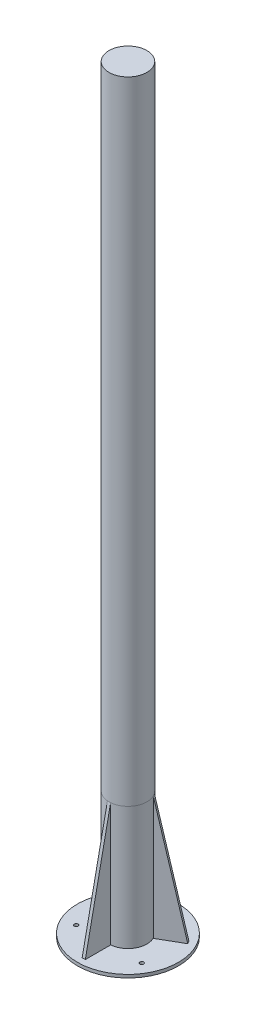
ISO-10303-21;
HEADER;
FILE_DESCRIPTION(('STEP AP214'),'2;1');
FILE_NAME('part.step','',(''),(''),'','','');
FILE_SCHEMA(('AUTOMOTIVE_DESIGN { 1 0 10303 214 1 1 1 1 }'));
ENDSEC;
DATA;
#1=APPLICATION_CONTEXT('core data for automotive mechanical design processes');
#2=APPLICATION_PROTOCOL_DEFINITION('international standard','automotive_design',2000,#1);
#3=PRODUCT_CONTEXT('',#1,'mechanical');
#4=PRODUCT('Part','Part','',(#3));
#5=PRODUCT_RELATED_PRODUCT_CATEGORY('part','',(#4));
#6=PRODUCT_DEFINITION_FORMATION('','',#4);
#7=PRODUCT_DEFINITION_CONTEXT('part definition',#1,'design');
#8=PRODUCT_DEFINITION('design','',#6,#7);
#9=PRODUCT_DEFINITION_SHAPE('','',#8);
#10=(LENGTH_UNIT() NAMED_UNIT(*) SI_UNIT(.MILLI.,.METRE.));
#11=(NAMED_UNIT(*) PLANE_ANGLE_UNIT() SI_UNIT($,.RADIAN.));
#12=(NAMED_UNIT(*) SI_UNIT($,.STERADIAN.) SOLID_ANGLE_UNIT());
#13=UNCERTAINTY_MEASURE_WITH_UNIT(LENGTH_MEASURE(1.E-05),#10,'distance_accuracy_value','');
#14=(GEOMETRIC_REPRESENTATION_CONTEXT(3) GLOBAL_UNCERTAINTY_ASSIGNED_CONTEXT((#13)) GLOBAL_UNIT_ASSIGNED_CONTEXT((#10,
#11,#12)) REPRESENTATION_CONTEXT('',''));
#15=CARTESIAN_POINT('',(0.,0.,0.));
#16=DIRECTION('',(0.,0.,1.));
#17=DIRECTION('',(1.,0.,0.));
#18=AXIS2_PLACEMENT_3D('',#15,#16,#17);
#19=CARTESIAN_POINT('',(0.,1195.,0.));
#20=DIRECTION('',(0.,-1.,0.));
#21=DIRECTION('',(0.,0.,-1.));
#22=AXIS2_PLACEMENT_3D('',#19,#20,#21);
#23=CYLINDRICAL_SURFACE('',#22,30.);
#24=CARTESIAN_POINT('',(0.,1195.,0.));
#25=DIRECTION('',(0.,1.,0.));
#26=DIRECTION('',(0.,0.,1.));
#27=AXIS2_PLACEMENT_3D('',#24,#25,#26);
#28=CIRCLE('',#27,30.);
#29=CARTESIAN_POINT('',(0.,1195.,30.));
#30=VERTEX_POINT('',#29);
#31=EDGE_CURVE('E11',#30,#30,#28,.T.);
#32=ORIENTED_EDGE('',*,*,#31,.F.);
#33=EDGE_LOOP('',(#32));
#34=FACE_BOUND('',#33,.T.);
#35=CARTESIAN_POINT('',(0.,195.,0.));
#36=DIRECTION('',(0.,1.,0.));
#37=DIRECTION('',(0.,0.,1.));
#38=AXIS2_PLACEMENT_3D('',#35,#36,#37);
#39=CIRCLE('',#38,30.);
#40=CARTESIAN_POINT('',(0.,195.,30.));
#41=VERTEX_POINT('',#40);
#42=EDGE_CURVE('E48',#41,#41,#39,.T.);
#43=ORIENTED_EDGE('',*,*,#42,.T.);
#44=EDGE_LOOP('',(#43));
#45=FACE_BOUND('',#44,.T.);
#46=ADVANCED_FACE('F45',(#34,#45),#23,.T.);
#47=CARTESIAN_POINT('',(0.,1195.,0.));
#48=DIRECTION('',(0.,1.,0.));
#49=DIRECTION('',(0.,0.,1.));
#50=AXIS2_PLACEMENT_3D('',#47,#48,#49);
#51=PLANE('',#50);
#52=ORIENTED_EDGE('',*,*,#31,.T.);
#53=EDGE_LOOP('',(#52));
#54=FACE_BOUND('',#53,.T.);
#55=ADVANCED_FACE('F60',(#54),#51,.T.);
#56=CARTESIAN_POINT('',(0.,195.,0.));
#57=DIRECTION('',(0.,1.,0.));
#58=DIRECTION('',(0.,0.,1.));
#59=AXIS2_PLACEMENT_3D('',#56,#57,#58);
#60=PLANE('',#59);
#61=ORIENTED_EDGE('',*,*,#42,.F.);
#62=EDGE_LOOP('',(#61));
#63=FACE_BOUND('',#62,.T.);
#64=ADVANCED_FACE('F58',(#63),#60,.F.);
#65=CLOSED_SHELL('',(#46,#55,#64));
#66=MANIFOLD_SOLID_BREP('B2',#65);
#67=CARTESIAN_POINT('',(-24.7307621135333,195.,-17.1650635094609));
#68=DIRECTION('',(-0.848360824371378,0.200944143721331,-0.489801350320737));
#69=DIRECTION('',(-0.174022733204385,-0.97960270064149,-0.100472071860664));
#70=AXIS2_PLACEMENT_3D('',#67,#68,#69);
#71=PLANE('',#70);
#72=DIRECTION('',(-0.499999999999992,0.,0.866025403784443));
#73=VECTOR('',#72,1.);
#74=CARTESIAN_POINT('',(-59.3717782649111,0.,-37.1650635094605));
#75=LINE('',#74,#73);
#76=CARTESIAN_POINT('',(-59.3717782649111,0.,-37.1650635094605));
#77=VERTEX_POINT('',#76);
#78=CARTESIAN_POINT('',(-61.871778264911,0.,-32.8349364905383));
#79=VERTEX_POINT('',#78);
#80=EDGE_CURVE('E100',#77,#79,#75,.T.);
#81=ORIENTED_EDGE('',*,*,#80,.T.);
#82=DIRECTION('',(-0.174022733204385,-0.97960270064149,-0.100472071860664));
#83=VECTOR('',#82,1.);
#84=CARTESIAN_POINT('',(-27.2307621135333,195.,-12.8349364905386));
#85=LINE('',#84,#83);
#86=CARTESIAN_POINT('',(-27.2307621135333,195.,-12.8349364905386));
#87=VERTEX_POINT('',#86);
#88=EDGE_CURVE('E131',#87,#79,#85,.T.);
#89=ORIENTED_EDGE('',*,*,#88,.F.);
#90=DIRECTION('',(-0.499999999999992,0.,0.866025403784443));
#91=VECTOR('',#90,1.);
#92=CARTESIAN_POINT('',(-24.7307621135333,195.,-17.1650635094609));
#93=LINE('',#92,#91);
#94=CARTESIAN_POINT('',(-24.7307621135333,195.,-17.1650635094609));
#95=VERTEX_POINT('',#94);
#96=EDGE_CURVE('E43',#95,#87,#93,.T.);
#97=ORIENTED_EDGE('',*,*,#96,.F.);
#98=DIRECTION('',(-0.174022733204385,-0.97960270064149,-0.100472071860664));
#99=VECTOR('',#98,1.);
#100=CARTESIAN_POINT('',(-24.7307621135333,195.,-17.1650635094609));
#101=LINE('',#100,#99);
#102=EDGE_CURVE('E132',#95,#77,#101,.T.);
#103=ORIENTED_EDGE('',*,*,#102,.T.);
#104=EDGE_LOOP('',(#81,#89,#97,#103));
#105=FACE_BOUND('',#104,.T.);
#106=ADVANCED_FACE('F97',(#105),#71,.T.);
#107=CARTESIAN_POINT('',(-24.7307621135333,0.,-17.1650635094609));
#108=DIRECTION('',(0.866025403784443,0.,0.499999999999992));
#109=DIRECTION('',(0.499999999999992,0.,-0.866025403784443));
#110=AXIS2_PLACEMENT_3D('',#107,#108,#109);
#111=PLANE('',#110);
#112=ORIENTED_EDGE('',*,*,#96,.T.);
#113=DIRECTION('',(0.,1.,0.));
#114=VECTOR('',#113,1.);
#115=CARTESIAN_POINT('',(-27.2307621135333,0.,-12.8349364905386));
#116=LINE('',#115,#114);
#117=CARTESIAN_POINT('',(-27.2307621135333,0.,-12.8349364905386));
#118=VERTEX_POINT('',#117);
#119=EDGE_CURVE('E141',#118,#87,#116,.T.);
#120=ORIENTED_EDGE('',*,*,#119,.F.);
#121=DIRECTION('',(-0.499999999999992,0.,0.866025403784443));
#122=VECTOR('',#121,1.);
#123=CARTESIAN_POINT('',(-24.7307621135333,0.,-17.1650635094609));
#124=LINE('',#123,#122);
#125=CARTESIAN_POINT('',(-24.7307621135333,0.,-17.1650635094609));
#126=VERTEX_POINT('',#125);
#127=EDGE_CURVE('E105',#126,#118,#124,.T.);
#128=ORIENTED_EDGE('',*,*,#127,.F.);
#129=DIRECTION('',(0.,1.,0.));
#130=VECTOR('',#129,1.);
#131=CARTESIAN_POINT('',(-24.7307621135333,0.,-17.1650635094609));
#132=LINE('',#131,#130);
#133=EDGE_CURVE('E135',#126,#95,#132,.T.);
#134=ORIENTED_EDGE('',*,*,#133,.T.);
#135=EDGE_LOOP('',(#112,#120,#128,#134));
#136=FACE_BOUND('',#135,.T.);
#137=ADVANCED_FACE('F151',(#136),#111,.T.);
#138=CARTESIAN_POINT('',(-59.3717782649111,0.,-37.1650635094605));
#139=DIRECTION('',(0.,-1.,0.));
#140=DIRECTION('',(0.866025403784443,0.,0.499999999999992));
#141=AXIS2_PLACEMENT_3D('',#138,#139,#140);
#142=PLANE('',#141);
#143=ORIENTED_EDGE('',*,*,#127,.T.);
#144=DIRECTION('',(0.866025403784443,0.,0.499999999999992));
#145=VECTOR('',#144,1.);
#146=CARTESIAN_POINT('',(-61.871778264911,0.,-32.8349364905383));
#147=LINE('',#146,#145);
#148=EDGE_CURVE('E137',#79,#118,#147,.T.);
#149=ORIENTED_EDGE('',*,*,#148,.F.);
#150=ORIENTED_EDGE('',*,*,#80,.F.);
#151=DIRECTION('',(0.866025403784443,0.,0.499999999999992));
#152=VECTOR('',#151,1.);
#153=CARTESIAN_POINT('',(-59.3717782649111,0.,-37.1650635094605));
#154=LINE('',#153,#152);
#155=EDGE_CURVE('E148',#77,#126,#154,.T.);
#156=ORIENTED_EDGE('',*,*,#155,.T.);
#157=EDGE_LOOP('',(#143,#149,#150,#156));
#158=FACE_BOUND('',#157,.T.);
#159=ADVANCED_FACE('F138',(#158),#142,.T.);
#160=CARTESIAN_POINT('',(1.24999999999998,0.,-2.16506350946111));
#161=DIRECTION('',(-0.499999999999992,0.,0.866025403784443));
#162=DIRECTION('',(0.866025403784443,0.,0.499999999999992));
#163=AXIS2_PLACEMENT_3D('',#160,#161,#162);
#164=PLANE('',#163);
#165=ORIENTED_EDGE('',*,*,#102,.F.);
#166=ORIENTED_EDGE('',*,*,#133,.F.);
#167=ORIENTED_EDGE('',*,*,#155,.F.);
#168=EDGE_LOOP('',(#165,#166,#167));
#169=FACE_BOUND('',#168,.T.);
#170=ADVANCED_FACE('F153',(#169),#164,.F.);
#171=CARTESIAN_POINT('',(-1.24999999999998,0.,2.16506350946111));
#172=DIRECTION('',(-0.499999999999992,0.,0.866025403784443));
#173=DIRECTION('',(0.866025403784443,0.,0.499999999999992));
#174=AXIS2_PLACEMENT_3D('',#171,#172,#173);
#175=PLANE('',#174);
#176=ORIENTED_EDGE('',*,*,#88,.T.);
#177=ORIENTED_EDGE('',*,*,#148,.T.);
#178=ORIENTED_EDGE('',*,*,#119,.T.);
#179=EDGE_LOOP('',(#176,#177,#178));
#180=FACE_BOUND('',#179,.T.);
#181=ADVANCED_FACE('F143',(#180),#175,.T.);
#182=CLOSED_SHELL('',(#106,#137,#159,#170,#181));
#183=MANIFOLD_SOLID_BREP('B6',#182);
#184=CARTESIAN_POINT('',(27.2307621135331,195.,-12.834936490539));
#185=DIRECTION('',(0.848360824371371,0.200944143721331,-0.489801350320749));
#186=DIRECTION('',(0.174022733204384,-0.97960270064149,-0.100472071860666));
#187=AXIS2_PLACEMENT_3D('',#184,#185,#186);
#188=PLANE('',#187);
#189=DIRECTION('',(-0.500000000000004,0.,-0.866025403784436));
#190=VECTOR('',#189,1.);
#191=CARTESIAN_POINT('',(61.8717782649106,0.,-32.8349364905392));
#192=LINE('',#191,#190);
#193=CARTESIAN_POINT('',(61.8717782649106,0.,-32.8349364905392));
#194=VERTEX_POINT('',#193);
#195=CARTESIAN_POINT('',(59.3717782649106,0.,-37.1650635094614));
#196=VERTEX_POINT('',#195);
#197=EDGE_CURVE('E207',#194,#196,#192,.T.);
#198=ORIENTED_EDGE('',*,*,#197,.T.);
#199=DIRECTION('',(0.174022733204384,-0.97960270064149,-0.100472071860666));
#200=VECTOR('',#199,1.);
#201=CARTESIAN_POINT('',(24.7307621135331,195.,-17.1650635094612));
#202=LINE('',#201,#200);
#203=CARTESIAN_POINT('',(24.7307621135331,195.,-17.1650635094612));
#204=VERTEX_POINT('',#203);
#205=EDGE_CURVE('E238',#204,#196,#202,.T.);
#206=ORIENTED_EDGE('',*,*,#205,.F.);
#207=DIRECTION('',(-0.500000000000004,0.,-0.866025403784436));
#208=VECTOR('',#207,1.);
#209=CARTESIAN_POINT('',(27.2307621135331,195.,-12.834936490539));
#210=LINE('',#209,#208);
#211=CARTESIAN_POINT('',(27.2307621135331,195.,-12.834936490539));
#212=VERTEX_POINT('',#211);
#213=EDGE_CURVE('E95',#212,#204,#210,.T.);
#214=ORIENTED_EDGE('',*,*,#213,.F.);
#215=DIRECTION('',(0.174022733204384,-0.97960270064149,-0.100472071860666));
#216=VECTOR('',#215,1.);
#217=CARTESIAN_POINT('',(27.2307621135331,195.,-12.834936490539));
#218=LINE('',#217,#216);
#219=EDGE_CURVE('E239',#212,#194,#218,.T.);
#220=ORIENTED_EDGE('',*,*,#219,.T.);
#221=EDGE_LOOP('',(#198,#206,#214,#220));
#222=FACE_BOUND('',#221,.T.);
#223=ADVANCED_FACE('F204',(#222),#188,.T.);
#224=CARTESIAN_POINT('',(27.2307621135331,0.,-12.834936490539));
#225=DIRECTION('',(-0.866025403784436,0.,0.500000000000004));
#226=DIRECTION('',(0.500000000000004,0.,0.866025403784436));
#227=AXIS2_PLACEMENT_3D('',#224,#225,#226);
#228=PLANE('',#227);
#229=ORIENTED_EDGE('',*,*,#213,.T.);
#230=DIRECTION('',(0.,1.,0.));
#231=VECTOR('',#230,1.);
#232=CARTESIAN_POINT('',(24.7307621135331,0.,-17.1650635094612));
#233=LINE('',#232,#231);
#234=CARTESIAN_POINT('',(24.7307621135331,0.,-17.1650635094612));
#235=VERTEX_POINT('',#234);
#236=EDGE_CURVE('E248',#235,#204,#233,.T.);
#237=ORIENTED_EDGE('',*,*,#236,.F.);
#238=DIRECTION('',(-0.500000000000004,0.,-0.866025403784436));
#239=VECTOR('',#238,1.);
#240=CARTESIAN_POINT('',(27.2307621135331,0.,-12.834936490539));
#241=LINE('',#240,#239);
#242=CARTESIAN_POINT('',(27.2307621135331,0.,-12.834936490539));
#243=VERTEX_POINT('',#242);
#244=EDGE_CURVE('E212',#243,#235,#241,.T.);
#245=ORIENTED_EDGE('',*,*,#244,.F.);
#246=DIRECTION('',(0.,1.,0.));
#247=VECTOR('',#246,1.);
#248=CARTESIAN_POINT('',(27.2307621135331,0.,-12.834936490539));
#249=LINE('',#248,#247);
#250=EDGE_CURVE('E242',#243,#212,#249,.T.);
#251=ORIENTED_EDGE('',*,*,#250,.T.);
#252=EDGE_LOOP('',(#229,#237,#245,#251));
#253=FACE_BOUND('',#252,.T.);
#254=ADVANCED_FACE('F258',(#253),#228,.T.);
#255=CARTESIAN_POINT('',(61.8717782649106,0.,-32.8349364905392));
#256=DIRECTION('',(0.,-1.,0.));
#257=DIRECTION('',(-0.866025403784436,0.,0.500000000000004));
#258=AXIS2_PLACEMENT_3D('',#255,#256,#257);
#259=PLANE('',#258);
#260=ORIENTED_EDGE('',*,*,#244,.T.);
#261=DIRECTION('',(-0.866025403784436,0.,0.500000000000004));
#262=VECTOR('',#261,1.);
#263=CARTESIAN_POINT('',(59.3717782649106,0.,-37.1650635094614));
#264=LINE('',#263,#262);
#265=EDGE_CURVE('E244',#196,#235,#264,.T.);
#266=ORIENTED_EDGE('',*,*,#265,.F.);
#267=ORIENTED_EDGE('',*,*,#197,.F.);
#268=DIRECTION('',(-0.866025403784436,0.,0.500000000000004));
#269=VECTOR('',#268,1.);
#270=CARTESIAN_POINT('',(61.8717782649106,0.,-32.8349364905392));
#271=LINE('',#270,#269);
#272=EDGE_CURVE('E255',#194,#243,#271,.T.);
#273=ORIENTED_EDGE('',*,*,#272,.T.);
#274=EDGE_LOOP('',(#260,#266,#267,#273));
#275=FACE_BOUND('',#274,.T.);
#276=ADVANCED_FACE('F245',(#275),#259,.T.);
#277=CARTESIAN_POINT('',(1.25000000000001,0.,2.16506350946109));
#278=DIRECTION('',(-0.500000000000004,0.,-0.866025403784436));
#279=DIRECTION('',(-0.866025403784436,0.,0.500000000000004));
#280=AXIS2_PLACEMENT_3D('',#277,#278,#279);
#281=PLANE('',#280);
#282=ORIENTED_EDGE('',*,*,#219,.F.);
#283=ORIENTED_EDGE('',*,*,#250,.F.);
#284=ORIENTED_EDGE('',*,*,#272,.F.);
#285=EDGE_LOOP('',(#282,#283,#284));
#286=FACE_BOUND('',#285,.T.);
#287=ADVANCED_FACE('F260',(#286),#281,.F.);
#288=CARTESIAN_POINT('',(-1.25000000000001,0.,-2.16506350946109));
#289=DIRECTION('',(-0.500000000000004,0.,-0.866025403784436));
#290=DIRECTION('',(-0.866025403784436,0.,0.500000000000004));
#291=AXIS2_PLACEMENT_3D('',#288,#289,#290);
#292=PLANE('',#291);
#293=ORIENTED_EDGE('',*,*,#205,.T.);
#294=ORIENTED_EDGE('',*,*,#265,.T.);
#295=ORIENTED_EDGE('',*,*,#236,.T.);
#296=EDGE_LOOP('',(#293,#294,#295));
#297=FACE_BOUND('',#296,.T.);
#298=ADVANCED_FACE('F250',(#297),#292,.T.);
#299=CLOSED_SHELL('',(#223,#254,#276,#287,#298));
#300=MANIFOLD_SOLID_BREP('B37',#299);
#301=CARTESIAN_POINT('',(-2.5,195.,30.));
#302=DIRECTION('',(0.,0.200944143721331,0.97960270064149));
#303=DIRECTION('',(0.,-0.97960270064149,0.200944143721331));
#304=AXIS2_PLACEMENT_3D('',#301,#302,#303);
#305=PLANE('',#304);
#306=DIRECTION('',(1.,0.,0.));
#307=VECTOR('',#306,1.);
#308=CARTESIAN_POINT('',(-2.5,0.,70.));
#309=LINE('',#308,#307);
#310=CARTESIAN_POINT('',(-2.5,0.,70.));
#311=VERTEX_POINT('',#310);
#312=CARTESIAN_POINT('',(2.5,0.,70.));
#313=VERTEX_POINT('',#312);
#314=EDGE_CURVE('E311',#311,#313,#309,.T.);
#315=ORIENTED_EDGE('',*,*,#314,.T.);
#316=DIRECTION('',(0.,-0.97960270064149,0.200944143721331));
#317=VECTOR('',#316,1.);
#318=CARTESIAN_POINT('',(2.5,195.,30.));
#319=LINE('',#318,#317);
#320=CARTESIAN_POINT('',(2.5,195.,30.));
#321=VERTEX_POINT('',#320);
#322=EDGE_CURVE('E342',#321,#313,#319,.T.);
#323=ORIENTED_EDGE('',*,*,#322,.F.);
#324=DIRECTION('',(1.,0.,0.));
#325=VECTOR('',#324,1.);
#326=CARTESIAN_POINT('',(-2.5,195.,30.));
#327=LINE('',#326,#325);
#328=CARTESIAN_POINT('',(-2.5,195.,30.));
#329=VERTEX_POINT('',#328);
#330=EDGE_CURVE('E202',#329,#321,#327,.T.);
#331=ORIENTED_EDGE('',*,*,#330,.F.);
#332=DIRECTION('',(0.,-0.97960270064149,0.200944143721331));
#333=VECTOR('',#332,1.);
#334=CARTESIAN_POINT('',(-2.5,195.,30.));
#335=LINE('',#334,#333);
#336=EDGE_CURVE('E343',#329,#311,#335,.T.);
#337=ORIENTED_EDGE('',*,*,#336,.T.);
#338=EDGE_LOOP('',(#315,#323,#331,#337));
#339=FACE_BOUND('',#338,.T.);
#340=ADVANCED_FACE('F308',(#339),#305,.T.);
#341=CARTESIAN_POINT('',(-2.5,0.,30.));
#342=DIRECTION('',(0.,0.,-1.));
#343=DIRECTION('',(-1.,0.,0.));
#344=AXIS2_PLACEMENT_3D('',#341,#342,#343);
#345=PLANE('',#344);
#346=ORIENTED_EDGE('',*,*,#330,.T.);
#347=DIRECTION('',(0.,1.,0.));
#348=VECTOR('',#347,1.);
#349=CARTESIAN_POINT('',(2.5,0.,30.));
#350=LINE('',#349,#348);
#351=CARTESIAN_POINT('',(2.5,0.,30.));
#352=VERTEX_POINT('',#351);
#353=EDGE_CURVE('E352',#352,#321,#350,.T.);
#354=ORIENTED_EDGE('',*,*,#353,.F.);
#355=DIRECTION('',(1.,0.,0.));
#356=VECTOR('',#355,1.);
#357=CARTESIAN_POINT('',(-2.5,0.,30.));
#358=LINE('',#357,#356);
#359=CARTESIAN_POINT('',(-2.5,0.,30.));
#360=VERTEX_POINT('',#359);
#361=EDGE_CURVE('E316',#360,#352,#358,.T.);
#362=ORIENTED_EDGE('',*,*,#361,.F.);
#363=DIRECTION('',(0.,1.,0.));
#364=VECTOR('',#363,1.);
#365=CARTESIAN_POINT('',(-2.5,0.,30.));
#366=LINE('',#365,#364);
#367=EDGE_CURVE('E346',#360,#329,#366,.T.);
#368=ORIENTED_EDGE('',*,*,#367,.T.);
#369=EDGE_LOOP('',(#346,#354,#362,#368));
#370=FACE_BOUND('',#369,.T.);
#371=ADVANCED_FACE('F362',(#370),#345,.T.);
#372=CARTESIAN_POINT('',(-2.5,0.,70.));
#373=DIRECTION('',(0.,-1.,0.));
#374=DIRECTION('',(0.,0.,-1.));
#375=AXIS2_PLACEMENT_3D('',#372,#373,#374);
#376=PLANE('',#375);
#377=ORIENTED_EDGE('',*,*,#361,.T.);
#378=DIRECTION('',(0.,0.,-1.));
#379=VECTOR('',#378,1.);
#380=CARTESIAN_POINT('',(2.5,0.,70.));
#381=LINE('',#380,#379);
#382=EDGE_CURVE('E348',#313,#352,#381,.T.);
#383=ORIENTED_EDGE('',*,*,#382,.F.);
#384=ORIENTED_EDGE('',*,*,#314,.F.);
#385=DIRECTION('',(0.,0.,-1.));
#386=VECTOR('',#385,1.);
#387=CARTESIAN_POINT('',(-2.5,0.,70.));
#388=LINE('',#387,#386);
#389=EDGE_CURVE('E359',#311,#360,#388,.T.);
#390=ORIENTED_EDGE('',*,*,#389,.T.);
#391=EDGE_LOOP('',(#377,#383,#384,#390));
#392=FACE_BOUND('',#391,.T.);
#393=ADVANCED_FACE('F349',(#392),#376,.T.);
#394=CARTESIAN_POINT('',(-2.5,0.,0.));
#395=DIRECTION('',(1.,0.,0.));
#396=DIRECTION('',(0.,0.,-1.));
#397=AXIS2_PLACEMENT_3D('',#394,#395,#396);
#398=PLANE('',#397);
#399=ORIENTED_EDGE('',*,*,#336,.F.);
#400=ORIENTED_EDGE('',*,*,#367,.F.);
#401=ORIENTED_EDGE('',*,*,#389,.F.);
#402=EDGE_LOOP('',(#399,#400,#401));
#403=FACE_BOUND('',#402,.T.);
#404=ADVANCED_FACE('F364',(#403),#398,.F.);
#405=CARTESIAN_POINT('',(2.5,0.,0.));
#406=DIRECTION('',(1.,0.,0.));
#407=DIRECTION('',(0.,0.,-1.));
#408=AXIS2_PLACEMENT_3D('',#405,#406,#407);
#409=PLANE('',#408);
#410=ORIENTED_EDGE('',*,*,#322,.T.);
#411=ORIENTED_EDGE('',*,*,#382,.T.);
#412=ORIENTED_EDGE('',*,*,#353,.T.);
#413=EDGE_LOOP('',(#410,#411,#412));
#414=FACE_BOUND('',#413,.T.);
#415=ADVANCED_FACE('F354',(#414),#409,.T.);
#416=CLOSED_SHELL('',(#340,#371,#393,#404,#415));
#417=MANIFOLD_SOLID_BREP('B89',#416);
#418=CARTESIAN_POINT('',(0.,-5.,0.));
#419=DIRECTION('',(0.,1.,0.));
#420=DIRECTION('',(0.,0.,1.));
#421=AXIS2_PLACEMENT_3D('',#418,#419,#420);
#422=CYLINDRICAL_SURFACE('',#421,80.);
#423=CARTESIAN_POINT('',(0.,-5.,0.));
#424=DIRECTION('',(0.,1.,0.));
#425=DIRECTION('',(0.,0.,1.));
#426=AXIS2_PLACEMENT_3D('',#423,#424,#425);
#427=CIRCLE('',#426,80.);
#428=CARTESIAN_POINT('',(0.,-5.,80.));
#429=VERTEX_POINT('',#428);
#430=EDGE_CURVE('E412',#429,#429,#427,.T.);
#431=ORIENTED_EDGE('',*,*,#430,.T.);
#432=EDGE_LOOP('',(#431));
#433=FACE_BOUND('',#432,.T.);
#434=CARTESIAN_POINT('',(0.,0.,0.));
#435=DIRECTION('',(0.,1.,0.));
#436=DIRECTION('',(0.,0.,1.));
#437=AXIS2_PLACEMENT_3D('',#434,#435,#436);
#438=CIRCLE('',#437,80.);
#439=CARTESIAN_POINT('',(0.,0.,80.));
#440=VERTEX_POINT('',#439);
#441=EDGE_CURVE('E408',#440,#440,#438,.T.);
#442=ORIENTED_EDGE('',*,*,#441,.F.);
#443=EDGE_LOOP('',(#442));
#444=FACE_BOUND('',#443,.T.);
#445=ADVANCED_FACE('F405',(#433,#444),#422,.T.);
#446=CARTESIAN_POINT('',(0.,-5.,0.));
#447=DIRECTION('',(0.,1.,0.));
#448=DIRECTION('',(0.,0.,1.));
#449=AXIS2_PLACEMENT_3D('',#446,#447,#448);
#450=PLANE('',#449);
#451=CARTESIAN_POINT('',(0.,-5.,-60.));
#452=DIRECTION('',(0.,1.,0.));
#453=DIRECTION('',(0.,0.,1.));
#454=AXIS2_PLACEMENT_3D('',#451,#452,#453);
#455=CIRCLE('',#454,3.);
#456=CARTESIAN_POINT('',(0.,-5.,-57.));
#457=VERTEX_POINT('',#456);
#458=EDGE_CURVE('E421',#457,#457,#455,.T.);
#459=ORIENTED_EDGE('',*,*,#458,.T.);
#460=EDGE_LOOP('',(#459));
#461=FACE_BOUND('',#460,.T.);
#462=CARTESIAN_POINT('',(51.9615242270689,-5.,29.9999999999985));
#463=DIRECTION('',(0.,1.,0.));
#464=DIRECTION('',(0.,0.,1.));
#465=AXIS2_PLACEMENT_3D('',#462,#463,#464);
#466=CIRCLE('',#465,3.00000000000229);
#467=CARTESIAN_POINT('',(51.9615242270689,-5.,33.0000000000008));
#468=VERTEX_POINT('',#467);
#469=EDGE_CURVE('E431',#468,#468,#466,.T.);
#470=ORIENTED_EDGE('',*,*,#469,.T.);
#471=EDGE_LOOP('',(#470));
#472=FACE_BOUND('',#471,.T.);
#473=CARTESIAN_POINT('',(-51.9615242270638,-5.,30.0000000000015));
#474=DIRECTION('',(0.,1.,0.));
#475=DIRECTION('',(0.,0.,1.));
#476=AXIS2_PLACEMENT_3D('',#473,#474,#475);
#477=CIRCLE('',#476,3.00000000000343);
#478=CARTESIAN_POINT('',(-51.9615242270638,-5.,33.0000000000049));
#479=VERTEX_POINT('',#478);
#480=EDGE_CURVE('E425',#479,#479,#477,.T.);
#481=ORIENTED_EDGE('',*,*,#480,.T.);
#482=EDGE_LOOP('',(#481));
#483=FACE_BOUND('',#482,.T.);
#484=ORIENTED_EDGE('',*,*,#430,.F.);
#485=EDGE_LOOP('',(#484));
#486=FACE_BOUND('',#485,.T.);
#487=ADVANCED_FACE('F440',(#461,#472,#483,#486),#450,.F.);
#488=CARTESIAN_POINT('',(0.,0.,0.));
#489=DIRECTION('',(0.,1.,0.));
#490=DIRECTION('',(0.,0.,1.));
#491=AXIS2_PLACEMENT_3D('',#488,#489,#490);
#492=PLANE('',#491);
#493=CARTESIAN_POINT('',(0.,0.,-60.));
#494=DIRECTION('',(0.,1.,0.));
#495=DIRECTION('',(0.,0.,1.));
#496=AXIS2_PLACEMENT_3D('',#493,#494,#495);
#497=CIRCLE('',#496,3.);
#498=CARTESIAN_POINT('',(0.,0.,-57.));
#499=VERTEX_POINT('',#498);
#500=EDGE_CURVE('E434',#499,#499,#497,.T.);
#501=ORIENTED_EDGE('',*,*,#500,.F.);
#502=EDGE_LOOP('',(#501));
#503=FACE_BOUND('',#502,.T.);
#504=CARTESIAN_POINT('',(51.9615242270689,0.,29.9999999999985));
#505=DIRECTION('',(0.,1.,0.));
#506=DIRECTION('',(0.,0.,1.));
#507=AXIS2_PLACEMENT_3D('',#504,#505,#506);
#508=CIRCLE('',#507,3.00000000000229);
#509=CARTESIAN_POINT('',(51.9615242270689,0.,33.0000000000008));
#510=VERTEX_POINT('',#509);
#511=EDGE_CURVE('E428',#510,#510,#508,.T.);
#512=ORIENTED_EDGE('',*,*,#511,.F.);
#513=EDGE_LOOP('',(#512));
#514=FACE_BOUND('',#513,.T.);
#515=CARTESIAN_POINT('',(-51.9615242270638,0.,30.0000000000015));
#516=DIRECTION('',(0.,1.,0.));
#517=DIRECTION('',(0.,0.,1.));
#518=AXIS2_PLACEMENT_3D('',#515,#516,#517);
#519=CIRCLE('',#518,3.00000000000343);
#520=CARTESIAN_POINT('',(-51.9615242270638,0.,33.0000000000049));
#521=VERTEX_POINT('',#520);
#522=EDGE_CURVE('E422',#521,#521,#519,.T.);
#523=ORIENTED_EDGE('',*,*,#522,.F.);
#524=EDGE_LOOP('',(#523));
#525=FACE_BOUND('',#524,.T.);
#526=CARTESIAN_POINT('',(0.,0.,0.));
#527=DIRECTION('',(0.,1.,0.));
#528=DIRECTION('',(0.,0.,1.));
#529=AXIS2_PLACEMENT_3D('',#526,#527,#528);
#530=CIRCLE('',#529,30.);
#531=CARTESIAN_POINT('',(0.,0.,30.));
#532=VERTEX_POINT('',#531);
#533=EDGE_CURVE('E307',#532,#532,#530,.T.);
#534=ORIENTED_EDGE('',*,*,#533,.F.);
#535=EDGE_LOOP('',(#534));
#536=FACE_BOUND('',#535,.T.);
#537=ORIENTED_EDGE('',*,*,#441,.T.);
#538=EDGE_LOOP('',(#537));
#539=FACE_BOUND('',#538,.T.);
#540=ADVANCED_FACE('F450',(#503,#514,#525,#536,#539),#492,.T.);
#541=CARTESIAN_POINT('',(0.,195.,0.));
#542=DIRECTION('',(0.,-1.,0.));
#543=DIRECTION('',(0.,0.,-1.));
#544=AXIS2_PLACEMENT_3D('',#541,#542,#543);
#545=CYLINDRICAL_SURFACE('',#544,30.);
#546=CARTESIAN_POINT('',(0.,195.,0.));
#547=DIRECTION('',(0.,1.,0.));
#548=DIRECTION('',(0.,0.,1.));
#549=AXIS2_PLACEMENT_3D('',#546,#547,#548);
#550=CIRCLE('',#549,30.);
#551=CARTESIAN_POINT('',(0.,195.,30.));
#552=VERTEX_POINT('',#551);
#553=EDGE_CURVE('E418',#552,#552,#550,.T.);
#554=ORIENTED_EDGE('',*,*,#553,.F.);
#555=EDGE_LOOP('',(#554));
#556=FACE_BOUND('',#555,.T.);
#557=ORIENTED_EDGE('',*,*,#533,.T.);
#558=EDGE_LOOP('',(#557));
#559=FACE_BOUND('',#558,.T.);
#560=ADVANCED_FACE('F453',(#556,#559),#545,.T.);
#561=CARTESIAN_POINT('',(0.,195.,0.));
#562=DIRECTION('',(0.,1.,0.));
#563=DIRECTION('',(0.,0.,1.));
#564=AXIS2_PLACEMENT_3D('',#561,#562,#563);
#565=PLANE('',#564);
#566=ORIENTED_EDGE('',*,*,#553,.T.);
#567=EDGE_LOOP('',(#566));
#568=FACE_BOUND('',#567,.T.);
#569=ADVANCED_FACE('F475',(#568),#565,.T.);
#570=CARTESIAN_POINT('',(-51.9615242270638,-5.,30.0000000000015));
#571=DIRECTION('',(0.,1.,0.));
#572=DIRECTION('',(0.,0.,1.));
#573=AXIS2_PLACEMENT_3D('',#570,#571,#572);
#574=CYLINDRICAL_SURFACE('',#573,3.00000000000343);
#575=ORIENTED_EDGE('',*,*,#480,.F.);
#576=EDGE_LOOP('',(#575));
#577=FACE_BOUND('',#576,.T.);
#578=ORIENTED_EDGE('',*,*,#522,.T.);
#579=EDGE_LOOP('',(#578));
#580=FACE_BOUND('',#579,.T.);
#581=ADVANCED_FACE('F479',(#577,#580),#574,.F.);
#582=CARTESIAN_POINT('',(51.9615242270689,-5.,29.9999999999985));
#583=DIRECTION('',(0.,1.,0.));
#584=DIRECTION('',(0.,0.,1.));
#585=AXIS2_PLACEMENT_3D('',#582,#583,#584);
#586=CYLINDRICAL_SURFACE('',#585,3.00000000000229);
#587=ORIENTED_EDGE('',*,*,#469,.F.);
#588=EDGE_LOOP('',(#587));
#589=FACE_BOUND('',#588,.T.);
#590=ORIENTED_EDGE('',*,*,#511,.T.);
#591=EDGE_LOOP('',(#590));
#592=FACE_BOUND('',#591,.T.);
#593=ADVANCED_FACE('F446',(#589,#592),#586,.F.);
#594=CARTESIAN_POINT('',(0.,-5.,-60.));
#595=DIRECTION('',(0.,1.,0.));
#596=DIRECTION('',(0.,0.,1.));
#597=AXIS2_PLACEMENT_3D('',#594,#595,#596);
#598=CYLINDRICAL_SURFACE('',#597,3.);
#599=ORIENTED_EDGE('',*,*,#458,.F.);
#600=EDGE_LOOP('',(#599));
#601=FACE_BOUND('',#600,.T.);
#602=ORIENTED_EDGE('',*,*,#500,.T.);
#603=EDGE_LOOP('',(#602));
#604=FACE_BOUND('',#603,.T.);
#605=ADVANCED_FACE('F443',(#601,#604),#598,.F.);
#606=CLOSED_SHELL('',(#445,#487,#540,#560,#569,#581,#593,#605));
#607=MANIFOLD_SOLID_BREP('B196',#606);
#608=ADVANCED_BREP_SHAPE_REPRESENTATION('',(#18,#66,#183,#300,#417,#607),#14);
#609=SHAPE_DEFINITION_REPRESENTATION(#9,#608);
ENDSEC;
END-ISO-10303-21;
